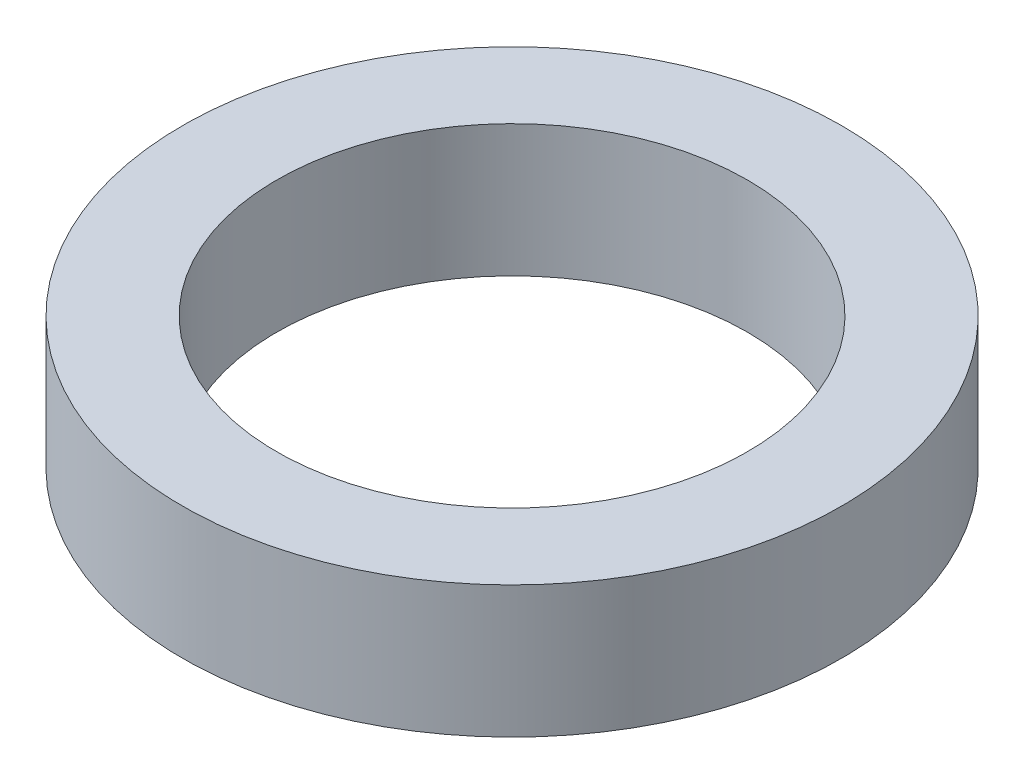
ISO-10303-21;
HEADER;
FILE_DESCRIPTION(('STEP AP214'),'2;1');
FILE_NAME('part.step','',(''),(''),'','','');
FILE_SCHEMA(('AUTOMOTIVE_DESIGN { 1 0 10303 214 1 1 1 1 }'));
ENDSEC;
DATA;
#1=APPLICATION_CONTEXT('core data for automotive mechanical design processes');
#2=APPLICATION_PROTOCOL_DEFINITION('international standard','automotive_design',2000,#1);
#3=PRODUCT_CONTEXT('',#1,'mechanical');
#4=PRODUCT('Part','Part','',(#3));
#5=PRODUCT_RELATED_PRODUCT_CATEGORY('part','',(#4));
#6=PRODUCT_DEFINITION_FORMATION('','',#4);
#7=PRODUCT_DEFINITION_CONTEXT('part definition',#1,'design');
#8=PRODUCT_DEFINITION('design','',#6,#7);
#9=PRODUCT_DEFINITION_SHAPE('','',#8);
#10=(LENGTH_UNIT() NAMED_UNIT(*) SI_UNIT(.MILLI.,.METRE.));
#11=(NAMED_UNIT(*) PLANE_ANGLE_UNIT() SI_UNIT($,.RADIAN.));
#12=(NAMED_UNIT(*) SI_UNIT($,.STERADIAN.) SOLID_ANGLE_UNIT());
#13=UNCERTAINTY_MEASURE_WITH_UNIT(LENGTH_MEASURE(1.E-05),#10,'distance_accuracy_value','');
#14=(GEOMETRIC_REPRESENTATION_CONTEXT(3) GLOBAL_UNCERTAINTY_ASSIGNED_CONTEXT((#13)) GLOBAL_UNIT_ASSIGNED_CONTEXT((#10,
#11,#12)) REPRESENTATION_CONTEXT('',''));
#15=CARTESIAN_POINT('',(0.,0.,0.));
#16=DIRECTION('',(0.,0.,1.));
#17=DIRECTION('',(1.,0.,0.));
#18=AXIS2_PLACEMENT_3D('',#15,#16,#17);
#19=CARTESIAN_POINT('',(0.,21.,0.));
#20=DIRECTION('',(0.,-1.,0.));
#21=DIRECTION('',(0.,0.,-1.));
#22=AXIS2_PLACEMENT_3D('',#19,#20,#21);
#23=CYLINDRICAL_SURFACE('',#22,52.5);
#24=CARTESIAN_POINT('',(0.,21.,0.));
#25=DIRECTION('',(0.,1.,0.));
#26=DIRECTION('',(0.,0.,1.));
#27=AXIS2_PLACEMENT_3D('',#24,#25,#26);
#28=CIRCLE('',#27,52.5);
#29=CARTESIAN_POINT('',(0.,21.,-52.5));
#30=VERTEX_POINT('',#29);
#31=EDGE_CURVE('E10',#30,#30,#28,.T.);
#32=CARTESIAN_POINT('',(0.,0.,0.));
#33=DIRECTION('',(0.,1.,0.));
#34=DIRECTION('',(0.,0.,1.));
#35=AXIS2_PLACEMENT_3D('',#32,#33,#34);
#36=CIRCLE('',#35,52.5);
#37=CARTESIAN_POINT('',(0.,0.,-52.5));
#38=VERTEX_POINT('',#37);
#39=EDGE_CURVE('E37',#38,#38,#36,.T.);
#40=CARTESIAN_POINT('',(0.,21.,-52.5));
#41=CARTESIAN_POINT('',(0.,20.78125,-52.5));
#42=CARTESIAN_POINT('',(0.,20.5625,-52.5));
#43=CARTESIAN_POINT('',(0.,20.125,-52.5));
#44=CARTESIAN_POINT('',(0.,19.90625,-52.5));
#45=CARTESIAN_POINT('',(0.,19.46875,-52.5));
#46=CARTESIAN_POINT('',(0.,19.25,-52.5));
#47=CARTESIAN_POINT('',(0.,18.8125,-52.5));
#48=CARTESIAN_POINT('',(0.,18.59375,-52.5));
#49=CARTESIAN_POINT('',(0.,18.15625,-52.5));
#50=CARTESIAN_POINT('',(0.,17.9375,-52.5));
#51=CARTESIAN_POINT('',(0.,17.5,-52.5));
#52=CARTESIAN_POINT('',(0.,17.28125,-52.5));
#53=CARTESIAN_POINT('',(0.,16.84375,-52.5));
#54=CARTESIAN_POINT('',(0.,16.625,-52.5));
#55=CARTESIAN_POINT('',(0.,16.1875,-52.5));
#56=CARTESIAN_POINT('',(0.,15.96875,-52.5));
#57=CARTESIAN_POINT('',(0.,15.53125,-52.5));
#58=CARTESIAN_POINT('',(0.,15.3125,-52.5));
#59=CARTESIAN_POINT('',(0.,14.875,-52.5));
#60=CARTESIAN_POINT('',(0.,14.65625,-52.5));
#61=CARTESIAN_POINT('',(0.,14.21875,-52.5));
#62=CARTESIAN_POINT('',(0.,14.,-52.5));
#63=CARTESIAN_POINT('',(0.,13.5625,-52.5));
#64=CARTESIAN_POINT('',(0.,13.34375,-52.5));
#65=CARTESIAN_POINT('',(0.,12.90625,-52.5));
#66=CARTESIAN_POINT('',(0.,12.6875,-52.5));
#67=CARTESIAN_POINT('',(0.,12.25,-52.5));
#68=CARTESIAN_POINT('',(0.,12.03125,-52.5));
#69=CARTESIAN_POINT('',(0.,11.59375,-52.5));
#70=CARTESIAN_POINT('',(0.,11.375,-52.5));
#71=CARTESIAN_POINT('',(0.,10.9375,-52.5));
#72=CARTESIAN_POINT('',(0.,10.71875,-52.5));
#73=CARTESIAN_POINT('',(0.,10.28125,-52.5));
#74=CARTESIAN_POINT('',(0.,10.0625,-52.5));
#75=CARTESIAN_POINT('',(0.,9.625,-52.5));
#76=CARTESIAN_POINT('',(0.,9.40625,-52.5));
#77=CARTESIAN_POINT('',(0.,8.96875,-52.5));
#78=CARTESIAN_POINT('',(0.,8.75,-52.5));
#79=CARTESIAN_POINT('',(0.,8.3125,-52.5));
#80=CARTESIAN_POINT('',(0.,8.09375,-52.5));
#81=CARTESIAN_POINT('',(0.,7.65625,-52.5));
#82=CARTESIAN_POINT('',(0.,7.4375,-52.5));
#83=CARTESIAN_POINT('',(0.,7.,-52.5));
#84=CARTESIAN_POINT('',(0.,6.78125,-52.5));
#85=CARTESIAN_POINT('',(0.,6.34375,-52.5));
#86=CARTESIAN_POINT('',(0.,6.125,-52.5));
#87=CARTESIAN_POINT('',(0.,5.6875,-52.5));
#88=CARTESIAN_POINT('',(0.,5.46875,-52.5));
#89=CARTESIAN_POINT('',(0.,5.03125,-52.5));
#90=CARTESIAN_POINT('',(0.,4.8125,-52.5));
#91=CARTESIAN_POINT('',(0.,4.375,-52.5));
#92=CARTESIAN_POINT('',(0.,4.15625,-52.5));
#93=CARTESIAN_POINT('',(0.,3.71875,-52.5));
#94=CARTESIAN_POINT('',(0.,3.5,-52.5));
#95=CARTESIAN_POINT('',(0.,3.0625,-52.5));
#96=CARTESIAN_POINT('',(0.,2.84375,-52.5));
#97=CARTESIAN_POINT('',(0.,2.40625,-52.5));
#98=CARTESIAN_POINT('',(0.,2.1875,-52.5));
#99=CARTESIAN_POINT('',(0.,1.75,-52.5));
#100=CARTESIAN_POINT('',(0.,1.53125,-52.5));
#101=CARTESIAN_POINT('',(0.,1.09375,-52.5));
#102=CARTESIAN_POINT('',(0.,0.875000000000001,-52.5));
#103=CARTESIAN_POINT('',(0.,0.4375,-52.5));
#104=CARTESIAN_POINT('',(0.,0.21875,-52.5));
#105=CARTESIAN_POINT('',(0.,0.,-52.5));
#106=B_SPLINE_CURVE_WITH_KNOTS('',3,(#40,#41,#42,#43,#44,#45,#46,#47,#48,#49,#50,#51,#52,#53,
#54,#55,#56,#57,#58,#59,#60,#61,#62,#63,#64,#65,#66,#67,#68,#69,#70,#71,#72,#73,#74,#75,#76,#77,
#78,#79,#80,#81,#82,#83,#84,#85,#86,#87,#88,#89,#90,#91,#92,#93,#94,#95,#96,#97,#98,#99,#100,
#101,#102,#103,#104,#105),.UNSPECIFIED.,.F.,.F.,(4,2,2,2,2,2,2,2,2,2,2,2,2,2,2,2,2,2,2,2,2,2,2,
2,2,2,2,2,2,2,2,2,4),(0.,0.656249999999997,1.3125,1.96875,2.625,3.28125,3.9375,4.59375,5.25,
5.90625,6.5625,7.21875,7.875,8.53125,9.1875,9.84375,10.5,11.15625,11.8125,12.46875,13.125,
13.78125,14.4375,15.09375,15.75,16.40625,17.0625,17.71875,18.375,19.03125,19.6875,20.34375,21.),.UNSPECIFIED.);
#107=EDGE_CURVE('BSEAM40',#30,#38,#106,.T.);
#108=ORIENTED_EDGE('',*,*,#31,.F.);
#109=ORIENTED_EDGE('',*,*,#39,.T.);
#110=ORIENTED_EDGE('',*,*,#107,.T.);
#111=ORIENTED_EDGE('',*,*,#107,.F.);
#112=EDGE_LOOP('',(#108,#110,#109,#111));
#113=FACE_BOUND('',#112,.T.);
#114=ADVANCED_FACE('F40',(#113),#23,.T.);
#115=CARTESIAN_POINT('',(0.,21.,0.));
#116=DIRECTION('',(0.,1.,0.));
#117=DIRECTION('',(0.,0.,1.));
#118=AXIS2_PLACEMENT_3D('',#115,#116,#117);
#119=PLANE('',#118);
#120=CARTESIAN_POINT('',(0.,21.,0.));
#121=DIRECTION('',(0.,1.,0.));
#122=DIRECTION('',(0.,0.,1.));
#123=AXIS2_PLACEMENT_3D('',#120,#121,#122);
#124=CIRCLE('',#123,37.5);
#125=CARTESIAN_POINT('',(0.,21.,-37.5));
#126=VERTEX_POINT('',#125);
#127=EDGE_CURVE('E50',#126,#126,#124,.T.);
#128=ORIENTED_EDGE('',*,*,#127,.F.);
#129=EDGE_LOOP('',(#128));
#130=FACE_BOUND('',#129,.T.);
#131=ORIENTED_EDGE('',*,*,#31,.T.);
#132=EDGE_LOOP('',(#131));
#133=FACE_BOUND('',#132,.T.);
#134=ADVANCED_FACE('F59',(#130,#133),#119,.T.);
#135=CARTESIAN_POINT('',(0.,0.,0.));
#136=DIRECTION('',(0.,1.,0.));
#137=DIRECTION('',(0.,0.,1.));
#138=AXIS2_PLACEMENT_3D('',#135,#136,#137);
#139=PLANE('',#138);
#140=CARTESIAN_POINT('',(0.,0.,0.));
#141=DIRECTION('',(0.,1.,0.));
#142=DIRECTION('',(0.,0.,1.));
#143=AXIS2_PLACEMENT_3D('',#140,#141,#142);
#144=CIRCLE('',#143,37.5);
#145=CARTESIAN_POINT('',(0.,0.,-37.5));
#146=VERTEX_POINT('',#145);
#147=EDGE_CURVE('E47',#146,#146,#144,.T.);
#148=ORIENTED_EDGE('',*,*,#147,.T.);
#149=EDGE_LOOP('',(#148));
#150=FACE_BOUND('',#149,.T.);
#151=ORIENTED_EDGE('',*,*,#39,.F.);
#152=EDGE_LOOP('',(#151));
#153=FACE_BOUND('',#152,.T.);
#154=ADVANCED_FACE('F58',(#150,#153),#139,.F.);
#155=CARTESIAN_POINT('',(0.,21.,0.));
#156=DIRECTION('',(0.,-1.,0.));
#157=DIRECTION('',(0.,0.,-1.));
#158=AXIS2_PLACEMENT_3D('',#155,#156,#157);
#159=CYLINDRICAL_SURFACE('',#158,37.5);
#160=CARTESIAN_POINT('',(0.,21.,-37.5));
#161=CARTESIAN_POINT('',(0.,20.78125,-37.5));
#162=CARTESIAN_POINT('',(0.,20.5625,-37.5));
#163=CARTESIAN_POINT('',(0.,20.125,-37.5));
#164=CARTESIAN_POINT('',(0.,19.90625,-37.5));
#165=CARTESIAN_POINT('',(0.,19.46875,-37.5));
#166=CARTESIAN_POINT('',(0.,19.25,-37.5));
#167=CARTESIAN_POINT('',(0.,18.8125,-37.5));
#168=CARTESIAN_POINT('',(0.,18.59375,-37.5));
#169=CARTESIAN_POINT('',(0.,18.15625,-37.5));
#170=CARTESIAN_POINT('',(0.,17.9375,-37.5));
#171=CARTESIAN_POINT('',(0.,17.5,-37.5));
#172=CARTESIAN_POINT('',(0.,17.28125,-37.5));
#173=CARTESIAN_POINT('',(0.,16.84375,-37.5));
#174=CARTESIAN_POINT('',(0.,16.625,-37.5));
#175=CARTESIAN_POINT('',(0.,16.1875,-37.5));
#176=CARTESIAN_POINT('',(0.,15.96875,-37.5));
#177=CARTESIAN_POINT('',(0.,15.53125,-37.5));
#178=CARTESIAN_POINT('',(0.,15.3125,-37.5));
#179=CARTESIAN_POINT('',(0.,14.875,-37.5));
#180=CARTESIAN_POINT('',(0.,14.65625,-37.5));
#181=CARTESIAN_POINT('',(0.,14.21875,-37.5));
#182=CARTESIAN_POINT('',(0.,14.,-37.5));
#183=CARTESIAN_POINT('',(0.,13.5625,-37.5));
#184=CARTESIAN_POINT('',(0.,13.34375,-37.5));
#185=CARTESIAN_POINT('',(0.,12.90625,-37.5));
#186=CARTESIAN_POINT('',(0.,12.6875,-37.5));
#187=CARTESIAN_POINT('',(0.,12.25,-37.5));
#188=CARTESIAN_POINT('',(0.,12.03125,-37.5));
#189=CARTESIAN_POINT('',(0.,11.59375,-37.5));
#190=CARTESIAN_POINT('',(0.,11.375,-37.5));
#191=CARTESIAN_POINT('',(0.,10.9375,-37.5));
#192=CARTESIAN_POINT('',(0.,10.71875,-37.5));
#193=CARTESIAN_POINT('',(0.,10.28125,-37.5));
#194=CARTESIAN_POINT('',(0.,10.0625,-37.5));
#195=CARTESIAN_POINT('',(0.,9.625,-37.5));
#196=CARTESIAN_POINT('',(0.,9.40625,-37.5));
#197=CARTESIAN_POINT('',(0.,8.96875,-37.5));
#198=CARTESIAN_POINT('',(0.,8.75,-37.5));
#199=CARTESIAN_POINT('',(0.,8.3125,-37.5));
#200=CARTESIAN_POINT('',(0.,8.09375,-37.5));
#201=CARTESIAN_POINT('',(0.,7.65625,-37.5));
#202=CARTESIAN_POINT('',(0.,7.4375,-37.5));
#203=CARTESIAN_POINT('',(0.,7.,-37.5));
#204=CARTESIAN_POINT('',(0.,6.78125,-37.5));
#205=CARTESIAN_POINT('',(0.,6.34375,-37.5));
#206=CARTESIAN_POINT('',(0.,6.125,-37.5));
#207=CARTESIAN_POINT('',(0.,5.6875,-37.5));
#208=CARTESIAN_POINT('',(0.,5.46875,-37.5));
#209=CARTESIAN_POINT('',(0.,5.03125,-37.5));
#210=CARTESIAN_POINT('',(0.,4.8125,-37.5));
#211=CARTESIAN_POINT('',(0.,4.375,-37.5));
#212=CARTESIAN_POINT('',(0.,4.15625,-37.5));
#213=CARTESIAN_POINT('',(0.,3.71875,-37.5));
#214=CARTESIAN_POINT('',(0.,3.5,-37.5));
#215=CARTESIAN_POINT('',(0.,3.0625,-37.5));
#216=CARTESIAN_POINT('',(0.,2.84375,-37.5));
#217=CARTESIAN_POINT('',(0.,2.40625,-37.5));
#218=CARTESIAN_POINT('',(0.,2.1875,-37.5));
#219=CARTESIAN_POINT('',(0.,1.75,-37.5));
#220=CARTESIAN_POINT('',(0.,1.53125,-37.5));
#221=CARTESIAN_POINT('',(0.,1.09375,-37.5));
#222=CARTESIAN_POINT('',(0.,0.875000000000001,-37.5));
#223=CARTESIAN_POINT('',(0.,0.4375,-37.5));
#224=CARTESIAN_POINT('',(0.,0.21875,-37.5));
#225=CARTESIAN_POINT('',(0.,0.,-37.5));
#226=B_SPLINE_CURVE_WITH_KNOTS('',3,(#160,#161,#162,#163,#164,#165,#166,#167,#168,#169,#170,
#171,#172,#173,#174,#175,#176,#177,#178,#179,#180,#181,#182,#183,#184,#185,#186,#187,#188,#189,
#190,#191,#192,#193,#194,#195,#196,#197,#198,#199,#200,#201,#202,#203,#204,#205,#206,#207,#208,
#209,#210,#211,#212,#213,#214,#215,#216,#217,#218,#219,#220,#221,#222,#223,#224,#225),
.UNSPECIFIED.,.F.,.F.,(4,2,2,2,2,2,2,2,2,2,2,2,2,2,2,2,2,2,2,2,2,2,2,2,2,2,2,2,2,2,2,2,4),(0.,
0.656249999999997,1.3125,1.96875,2.625,3.28125,3.9375,4.59375,5.25,5.90625,6.5625,7.21875,7.875,
8.53125,9.1875,9.84375,10.5,11.15625,11.8125,12.46875,13.125,13.78125,14.4375,15.09375,15.75,
16.40625,17.0625,17.71875,18.375,19.03125,19.6875,20.34375,21.),.UNSPECIFIED.);
#227=EDGE_CURVE('BSEAM54',#126,#146,#226,.T.);
#228=ORIENTED_EDGE('',*,*,#127,.T.);
#229=ORIENTED_EDGE('',*,*,#147,.F.);
#230=ORIENTED_EDGE('',*,*,#227,.T.);
#231=ORIENTED_EDGE('',*,*,#227,.F.);
#232=EDGE_LOOP('',(#228,#230,#229,#231));
#233=FACE_BOUND('',#232,.T.);
#234=ADVANCED_FACE('F54',(#233),#159,.F.);
#235=CLOSED_SHELL('',(#114,#134,#154,#234));
#236=MANIFOLD_SOLID_BREP('B2',#235);
#237=ADVANCED_BREP_SHAPE_REPRESENTATION('',(#18,#236),#14);
#238=SHAPE_DEFINITION_REPRESENTATION(#9,#237);
ENDSEC;
END-ISO-10303-21;
